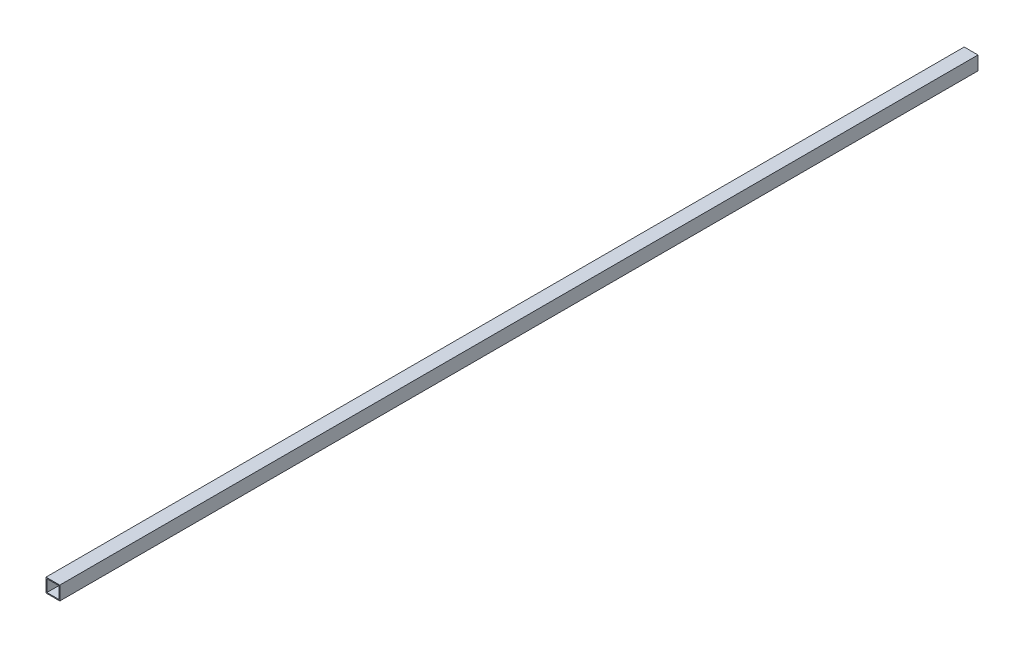
ISO-10303-21;
HEADER;
FILE_DESCRIPTION(('STEP AP214'),'2;1');
FILE_NAME('part.step','',(''),(''),'','','');
FILE_SCHEMA(('AUTOMOTIVE_DESIGN { 1 0 10303 214 1 1 1 1 }'));
ENDSEC;
DATA;
#1=APPLICATION_CONTEXT('core data for automotive mechanical design processes');
#2=APPLICATION_PROTOCOL_DEFINITION('international standard','automotive_design',2000,#1);
#3=PRODUCT_CONTEXT('',#1,'mechanical');
#4=PRODUCT('Part','Part','',(#3));
#5=PRODUCT_RELATED_PRODUCT_CATEGORY('part','',(#4));
#6=PRODUCT_DEFINITION_FORMATION('','',#4);
#7=PRODUCT_DEFINITION_CONTEXT('part definition',#1,'design');
#8=PRODUCT_DEFINITION('design','',#6,#7);
#9=PRODUCT_DEFINITION_SHAPE('','',#8);
#10=(LENGTH_UNIT() NAMED_UNIT(*) SI_UNIT(.MILLI.,.METRE.));
#11=(NAMED_UNIT(*) PLANE_ANGLE_UNIT() SI_UNIT($,.RADIAN.));
#12=(NAMED_UNIT(*) SI_UNIT($,.STERADIAN.) SOLID_ANGLE_UNIT());
#13=UNCERTAINTY_MEASURE_WITH_UNIT(LENGTH_MEASURE(1.E-05),#10,'distance_accuracy_value','');
#14=(GEOMETRIC_REPRESENTATION_CONTEXT(3) GLOBAL_UNCERTAINTY_ASSIGNED_CONTEXT((#13)) GLOBAL_UNIT_ASSIGNED_CONTEXT((#10,
#11,#12)) REPRESENTATION_CONTEXT('',''));
#15=CARTESIAN_POINT('',(0.,0.,0.));
#16=DIRECTION('',(0.,0.,1.));
#17=DIRECTION('',(1.,0.,0.));
#18=AXIS2_PLACEMENT_3D('',#15,#16,#17);
#19=CARTESIAN_POINT('',(0.,0.,1995.5));
#20=DIRECTION('',(0.,0.,-1.));
#21=DIRECTION('',(-1.,0.,0.));
#22=AXIS2_PLACEMENT_3D('',#19,#20,#21);
#23=PLANE('',#22);
#24=DIRECTION('',(0.,-1.,0.));
#25=VECTOR('',#24,1.);
#26=CARTESIAN_POINT('',(-15.,15.,1995.5));
#27=LINE('',#26,#25);
#28=CARTESIAN_POINT('',(-15.,15.,1995.5));
#29=VERTEX_POINT('',#28);
#30=CARTESIAN_POINT('',(-15.,-15.,1995.5));
#31=VERTEX_POINT('',#30);
#32=EDGE_CURVE('E153',#29,#31,#27,.T.);
#33=ORIENTED_EDGE('',*,*,#32,.T.);
#34=DIRECTION('',(1.,0.,0.));
#35=VECTOR('',#34,1.);
#36=CARTESIAN_POINT('',(15.,-15.,1995.5));
#37=LINE('',#36,#35);
#38=CARTESIAN_POINT('',(15.,-15.,1995.5));
#39=VERTEX_POINT('',#38);
#40=EDGE_CURVE('E157',#31,#39,#37,.T.);
#41=ORIENTED_EDGE('',*,*,#40,.T.);
#42=DIRECTION('',(0.,1.,0.));
#43=VECTOR('',#42,1.);
#44=CARTESIAN_POINT('',(15.,15.,1995.5));
#45=LINE('',#44,#43);
#46=CARTESIAN_POINT('',(15.,15.,1995.5));
#47=VERTEX_POINT('',#46);
#48=EDGE_CURVE('E161',#39,#47,#45,.T.);
#49=ORIENTED_EDGE('',*,*,#48,.T.);
#50=DIRECTION('',(-1.,0.,0.));
#51=VECTOR('',#50,1.);
#52=CARTESIAN_POINT('',(15.,15.,1995.5));
#53=LINE('',#52,#51);
#54=EDGE_CURVE('E164',#47,#29,#53,.T.);
#55=ORIENTED_EDGE('',*,*,#54,.T.);
#56=EDGE_LOOP('',(#33,#41,#49,#55));
#57=FACE_BOUND('',#56,.T.);
#58=DIRECTION('',(0.,1.,0.));
#59=VECTOR('',#58,1.);
#60=CARTESIAN_POINT('',(13.,13.,1995.5));
#61=LINE('',#60,#59);
#62=CARTESIAN_POINT('',(13.,-13.,1995.5));
#63=VERTEX_POINT('',#62);
#64=CARTESIAN_POINT('',(13.,13.,1995.5));
#65=VERTEX_POINT('',#64);
#66=EDGE_CURVE('E105',#63,#65,#61,.T.);
#67=ORIENTED_EDGE('',*,*,#66,.F.);
#68=DIRECTION('',(1.,0.,0.));
#69=VECTOR('',#68,1.);
#70=CARTESIAN_POINT('',(13.,-13.,1995.5));
#71=LINE('',#70,#69);
#72=CARTESIAN_POINT('',(-13.,-13.,1995.5));
#73=VERTEX_POINT('',#72);
#74=EDGE_CURVE('E131',#73,#63,#71,.T.);
#75=ORIENTED_EDGE('',*,*,#74,.F.);
#76=DIRECTION('',(0.,-1.,0.));
#77=VECTOR('',#76,1.);
#78=CARTESIAN_POINT('',(-13.,13.,1995.5));
#79=LINE('',#78,#77);
#80=CARTESIAN_POINT('',(-13.,13.,1995.5));
#81=VERTEX_POINT('',#80);
#82=EDGE_CURVE('E127',#81,#73,#79,.T.);
#83=ORIENTED_EDGE('',*,*,#82,.F.);
#84=DIRECTION('',(-1.,0.,0.));
#85=VECTOR('',#84,1.);
#86=CARTESIAN_POINT('',(13.,13.,1995.5));
#87=LINE('',#86,#85);
#88=EDGE_CURVE('E114',#65,#81,#87,.T.);
#89=ORIENTED_EDGE('',*,*,#88,.F.);
#90=EDGE_LOOP('',(#67,#75,#83,#89));
#91=FACE_BOUND('',#90,.T.);
#92=ADVANCED_FACE('F39',(#57,#91),#23,.F.);
#93=CARTESIAN_POINT('',(0.,0.,0.));
#94=DIRECTION('',(0.,0.,-1.));
#95=DIRECTION('',(-1.,0.,0.));
#96=AXIS2_PLACEMENT_3D('',#93,#94,#95);
#97=PLANE('',#96);
#98=DIRECTION('',(0.,-1.,0.));
#99=VECTOR('',#98,1.);
#100=CARTESIAN_POINT('',(-15.,15.,0.));
#101=LINE('',#100,#99);
#102=CARTESIAN_POINT('',(-15.,15.,0.));
#103=VERTEX_POINT('',#102);
#104=CARTESIAN_POINT('',(-15.,-15.,0.));
#105=VERTEX_POINT('',#104);
#106=EDGE_CURVE('E123',#103,#105,#101,.T.);
#107=ORIENTED_EDGE('',*,*,#106,.F.);
#108=DIRECTION('',(-1.,0.,0.));
#109=VECTOR('',#108,1.);
#110=CARTESIAN_POINT('',(15.,15.,0.));
#111=LINE('',#110,#109);
#112=CARTESIAN_POINT('',(15.,15.,0.));
#113=VERTEX_POINT('',#112);
#114=EDGE_CURVE('E158',#113,#103,#111,.T.);
#115=ORIENTED_EDGE('',*,*,#114,.F.);
#116=DIRECTION('',(0.,1.,0.));
#117=VECTOR('',#116,1.);
#118=CARTESIAN_POINT('',(15.,15.,0.));
#119=LINE('',#118,#117);
#120=CARTESIAN_POINT('',(15.,-15.,0.));
#121=VERTEX_POINT('',#120);
#122=EDGE_CURVE('E174',#121,#113,#119,.T.);
#123=ORIENTED_EDGE('',*,*,#122,.F.);
#124=DIRECTION('',(1.,0.,0.));
#125=VECTOR('',#124,1.);
#126=CARTESIAN_POINT('',(15.,-15.,0.));
#127=LINE('',#126,#125);
#128=EDGE_CURVE('E171',#105,#121,#127,.T.);
#129=ORIENTED_EDGE('',*,*,#128,.F.);
#130=EDGE_LOOP('',(#107,#115,#123,#129));
#131=FACE_BOUND('',#130,.T.);
#132=DIRECTION('',(1.,0.,0.));
#133=VECTOR('',#132,1.);
#134=CARTESIAN_POINT('',(13.,-13.,0.));
#135=LINE('',#134,#133);
#136=CARTESIAN_POINT('',(-13.,-13.,0.));
#137=VERTEX_POINT('',#136);
#138=CARTESIAN_POINT('',(13.,-13.,0.));
#139=VERTEX_POINT('',#138);
#140=EDGE_CURVE('E115',#137,#139,#135,.T.);
#141=ORIENTED_EDGE('',*,*,#140,.T.);
#142=DIRECTION('',(0.,1.,0.));
#143=VECTOR('',#142,1.);
#144=CARTESIAN_POINT('',(13.,13.,0.));
#145=LINE('',#144,#143);
#146=CARTESIAN_POINT('',(13.,13.,0.));
#147=VERTEX_POINT('',#146);
#148=EDGE_CURVE('E63',#139,#147,#145,.T.);
#149=ORIENTED_EDGE('',*,*,#148,.T.);
#150=DIRECTION('',(-1.,0.,0.));
#151=VECTOR('',#150,1.);
#152=CARTESIAN_POINT('',(13.,13.,0.));
#153=LINE('',#152,#151);
#154=CARTESIAN_POINT('',(-13.,13.,0.));
#155=VERTEX_POINT('',#154);
#156=EDGE_CURVE('E121',#147,#155,#153,.T.);
#157=ORIENTED_EDGE('',*,*,#156,.T.);
#158=DIRECTION('',(0.,-1.,0.));
#159=VECTOR('',#158,1.);
#160=CARTESIAN_POINT('',(-13.,13.,0.));
#161=LINE('',#160,#159);
#162=EDGE_CURVE('E140',#155,#137,#161,.T.);
#163=ORIENTED_EDGE('',*,*,#162,.T.);
#164=EDGE_LOOP('',(#141,#149,#157,#163));
#165=FACE_BOUND('',#164,.T.);
#166=ADVANCED_FACE('F197',(#131,#165),#97,.T.);
#167=CARTESIAN_POINT('',(-15.,15.,1995.5));
#168=DIRECTION('',(1.,0.,0.));
#169=DIRECTION('',(0.,1.,0.));
#170=AXIS2_PLACEMENT_3D('',#167,#168,#169);
#171=PLANE('',#170);
#172=ORIENTED_EDGE('',*,*,#106,.T.);
#173=DIRECTION('',(0.,0.,-1.));
#174=VECTOR('',#173,1.);
#175=CARTESIAN_POINT('',(-15.,-15.,1995.5));
#176=LINE('',#175,#174);
#177=EDGE_CURVE('E11',#31,#105,#176,.T.);
#178=ORIENTED_EDGE('',*,*,#177,.F.);
#179=ORIENTED_EDGE('',*,*,#32,.F.);
#180=DIRECTION('',(0.,0.,-1.));
#181=VECTOR('',#180,1.);
#182=CARTESIAN_POINT('',(-15.,15.,1995.5));
#183=LINE('',#182,#181);
#184=EDGE_CURVE('E167',#29,#103,#183,.T.);
#185=ORIENTED_EDGE('',*,*,#184,.T.);
#186=EDGE_LOOP('',(#172,#178,#179,#185));
#187=FACE_BOUND('',#186,.T.);
#188=ADVANCED_FACE('F41',(#187),#171,.F.);
#189=CARTESIAN_POINT('',(15.,-15.,1995.5));
#190=DIRECTION('',(0.,1.,0.));
#191=DIRECTION('',(-1.,0.,0.));
#192=AXIS2_PLACEMENT_3D('',#189,#190,#191);
#193=PLANE('',#192);
#194=ORIENTED_EDGE('',*,*,#128,.T.);
#195=DIRECTION('',(0.,0.,-1.));
#196=VECTOR('',#195,1.);
#197=CARTESIAN_POINT('',(15.,-15.,1995.5));
#198=LINE('',#197,#196);
#199=EDGE_CURVE('E48',#39,#121,#198,.T.);
#200=ORIENTED_EDGE('',*,*,#199,.F.);
#201=ORIENTED_EDGE('',*,*,#40,.F.);
#202=ORIENTED_EDGE('',*,*,#177,.T.);
#203=EDGE_LOOP('',(#194,#200,#201,#202));
#204=FACE_BOUND('',#203,.T.);
#205=ADVANCED_FACE('F207',(#204),#193,.F.);
#206=CARTESIAN_POINT('',(15.,15.,1995.5));
#207=DIRECTION('',(-1.,0.,0.));
#208=DIRECTION('',(0.,-1.,0.));
#209=AXIS2_PLACEMENT_3D('',#206,#207,#208);
#210=PLANE('',#209);
#211=ORIENTED_EDGE('',*,*,#122,.T.);
#212=DIRECTION('',(0.,0.,-1.));
#213=VECTOR('',#212,1.);
#214=CARTESIAN_POINT('',(15.,15.,1995.5));
#215=LINE('',#214,#213);
#216=EDGE_CURVE('E182',#47,#113,#215,.T.);
#217=ORIENTED_EDGE('',*,*,#216,.F.);
#218=ORIENTED_EDGE('',*,*,#48,.F.);
#219=ORIENTED_EDGE('',*,*,#199,.T.);
#220=EDGE_LOOP('',(#211,#217,#218,#219));
#221=FACE_BOUND('',#220,.T.);
#222=ADVANCED_FACE('F191',(#221),#210,.F.);
#223=CARTESIAN_POINT('',(15.,15.,1995.5));
#224=DIRECTION('',(0.,-1.,0.));
#225=DIRECTION('',(1.,0.,0.));
#226=AXIS2_PLACEMENT_3D('',#223,#224,#225);
#227=PLANE('',#226);
#228=ORIENTED_EDGE('',*,*,#114,.T.);
#229=ORIENTED_EDGE('',*,*,#184,.F.);
#230=ORIENTED_EDGE('',*,*,#54,.F.);
#231=ORIENTED_EDGE('',*,*,#216,.T.);
#232=EDGE_LOOP('',(#228,#229,#230,#231));
#233=FACE_BOUND('',#232,.T.);
#234=ADVANCED_FACE('F201',(#233),#227,.F.);
#235=CARTESIAN_POINT('',(13.,13.,1995.5));
#236=DIRECTION('',(-1.,0.,0.));
#237=DIRECTION('',(0.,-1.,0.));
#238=AXIS2_PLACEMENT_3D('',#235,#236,#237);
#239=PLANE('',#238);
#240=ORIENTED_EDGE('',*,*,#148,.F.);
#241=DIRECTION('',(0.,0.,-1.));
#242=VECTOR('',#241,1.);
#243=CARTESIAN_POINT('',(13.,-13.,1995.5));
#244=LINE('',#243,#242);
#245=EDGE_CURVE('E109',#63,#139,#244,.T.);
#246=ORIENTED_EDGE('',*,*,#245,.F.);
#247=ORIENTED_EDGE('',*,*,#66,.T.);
#248=DIRECTION('',(0.,0.,-1.));
#249=VECTOR('',#248,1.);
#250=CARTESIAN_POINT('',(13.,13.,1995.5));
#251=LINE('',#250,#249);
#252=EDGE_CURVE('E108',#65,#147,#251,.T.);
#253=ORIENTED_EDGE('',*,*,#252,.T.);
#254=EDGE_LOOP('',(#240,#246,#247,#253));
#255=FACE_BOUND('',#254,.T.);
#256=ADVANCED_FACE('F107',(#255),#239,.T.);
#257=CARTESIAN_POINT('',(13.,13.,1995.5));
#258=DIRECTION('',(0.,-1.,0.));
#259=DIRECTION('',(1.,0.,0.));
#260=AXIS2_PLACEMENT_3D('',#257,#258,#259);
#261=PLANE('',#260);
#262=ORIENTED_EDGE('',*,*,#156,.F.);
#263=ORIENTED_EDGE('',*,*,#252,.F.);
#264=ORIENTED_EDGE('',*,*,#88,.T.);
#265=DIRECTION('',(0.,0.,-1.));
#266=VECTOR('',#265,1.);
#267=CARTESIAN_POINT('',(-13.,13.,1995.5));
#268=LINE('',#267,#266);
#269=EDGE_CURVE('E124',#81,#155,#268,.T.);
#270=ORIENTED_EDGE('',*,*,#269,.T.);
#271=EDGE_LOOP('',(#262,#263,#264,#270));
#272=FACE_BOUND('',#271,.T.);
#273=ADVANCED_FACE('F118',(#272),#261,.T.);
#274=CARTESIAN_POINT('',(-13.,13.,1995.5));
#275=DIRECTION('',(1.,0.,0.));
#276=DIRECTION('',(0.,1.,0.));
#277=AXIS2_PLACEMENT_3D('',#274,#275,#276);
#278=PLANE('',#277);
#279=ORIENTED_EDGE('',*,*,#162,.F.);
#280=ORIENTED_EDGE('',*,*,#269,.F.);
#281=ORIENTED_EDGE('',*,*,#82,.T.);
#282=DIRECTION('',(0.,0.,-1.));
#283=VECTOR('',#282,1.);
#284=CARTESIAN_POINT('',(-13.,-13.,1995.5));
#285=LINE('',#284,#283);
#286=EDGE_CURVE('E55',#73,#137,#285,.T.);
#287=ORIENTED_EDGE('',*,*,#286,.T.);
#288=EDGE_LOOP('',(#279,#280,#281,#287));
#289=FACE_BOUND('',#288,.T.);
#290=ADVANCED_FACE('F230',(#289),#278,.T.);
#291=CARTESIAN_POINT('',(13.,-13.,1995.5));
#292=DIRECTION('',(0.,1.,0.));
#293=DIRECTION('',(-1.,0.,0.));
#294=AXIS2_PLACEMENT_3D('',#291,#292,#293);
#295=PLANE('',#294);
#296=ORIENTED_EDGE('',*,*,#140,.F.);
#297=ORIENTED_EDGE('',*,*,#286,.F.);
#298=ORIENTED_EDGE('',*,*,#74,.T.);
#299=ORIENTED_EDGE('',*,*,#245,.T.);
#300=EDGE_LOOP('',(#296,#297,#298,#299));
#301=FACE_BOUND('',#300,.T.);
#302=ADVANCED_FACE('F234',(#301),#295,.T.);
#303=CLOSED_SHELL('',(#92,#166,#188,#205,#222,#234,#256,#273,#290,#302));
#304=MANIFOLD_SOLID_BREP('B2',#303);
#305=ADVANCED_BREP_SHAPE_REPRESENTATION('',(#18,#304),#14);
#306=SHAPE_DEFINITION_REPRESENTATION(#9,#305);
ENDSEC;
END-ISO-10303-21;
